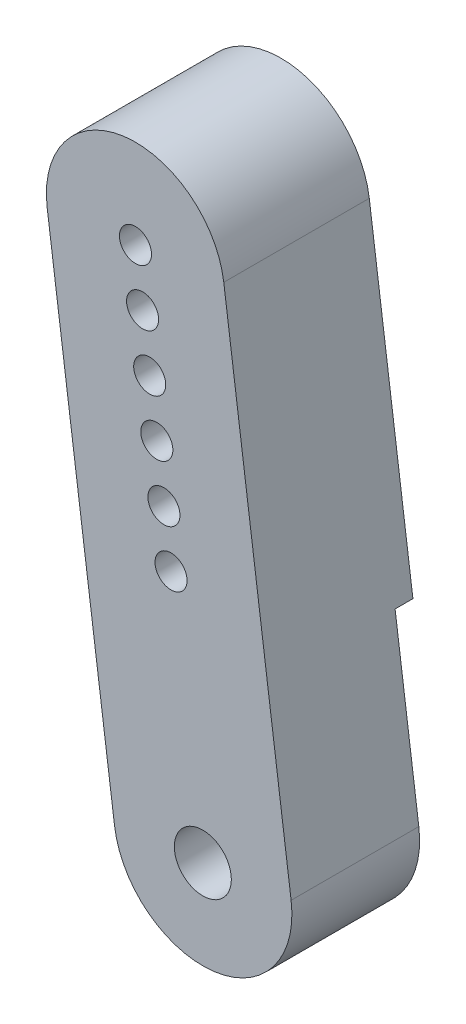
ISO-10303-21;
HEADER;
FILE_DESCRIPTION(('STEP AP214'),'2;1');
FILE_NAME('part.step','',(''),(''),'','','');
FILE_SCHEMA(('AUTOMOTIVE_DESIGN { 1 0 10303 214 1 1 1 1 }'));
ENDSEC;
DATA;
#1=APPLICATION_CONTEXT('core data for automotive mechanical design processes');
#2=APPLICATION_PROTOCOL_DEFINITION('international standard','automotive_design',2000,#1);
#3=PRODUCT_CONTEXT('',#1,'mechanical');
#4=PRODUCT('Part','Part','',(#3));
#5=PRODUCT_RELATED_PRODUCT_CATEGORY('part','',(#4));
#6=PRODUCT_DEFINITION_FORMATION('','',#4);
#7=PRODUCT_DEFINITION_CONTEXT('part definition',#1,'design');
#8=PRODUCT_DEFINITION('design','',#6,#7);
#9=PRODUCT_DEFINITION_SHAPE('','',#8);
#10=(LENGTH_UNIT() NAMED_UNIT(*) SI_UNIT(.MILLI.,.METRE.));
#11=(NAMED_UNIT(*) PLANE_ANGLE_UNIT() SI_UNIT($,.RADIAN.));
#12=(NAMED_UNIT(*) SI_UNIT($,.STERADIAN.) SOLID_ANGLE_UNIT());
#13=UNCERTAINTY_MEASURE_WITH_UNIT(LENGTH_MEASURE(1.E-05),#10,'distance_accuracy_value','');
#14=(GEOMETRIC_REPRESENTATION_CONTEXT(3) GLOBAL_UNCERTAINTY_ASSIGNED_CONTEXT((#13)) GLOBAL_UNIT_ASSIGNED_CONTEXT((#10,
#11,#12)) REPRESENTATION_CONTEXT('',''));
#15=CARTESIAN_POINT('',(0.,0.,0.));
#16=DIRECTION('',(0.,0.,1.));
#17=DIRECTION('',(1.,0.,0.));
#18=AXIS2_PLACEMENT_3D('',#15,#16,#17);
#19=CARTESIAN_POINT('',(-3.78016764213476,28.1472970744503,50.627013670889));
#20=DIRECTION('',(0.,0.,-1.));
#21=DIRECTION('',(-1.,0.,0.));
#22=AXIS2_PLACEMENT_3D('',#19,#20,#21);
#23=CYLINDRICAL_SURFACE('',#22,5.);
#24=CARTESIAN_POINT('',(-3.78016764213476,28.1472970744503,10.0670667486888));
#25=DIRECTION('',(0.,0.,1.));
#26=DIRECTION('',(1.,0.,0.));
#27=AXIS2_PLACEMENT_3D('',#24,#25,#26);
#28=CIRCLE('',#27,5.);
#29=CARTESIAN_POINT('',(1.17534240618396,28.8128195466571,10.0670667486888));
#30=VERTEX_POINT('',#29);
#31=CARTESIAN_POINT('',(-8.73567769045347,27.4817746022435,10.0670667486888));
#32=VERTEX_POINT('',#31);
#33=EDGE_CURVE('E133',#30,#32,#28,.T.);
#34=ORIENTED_EDGE('',*,*,#33,.F.);
#35=DIRECTION('',(0.,0.,-1.));
#36=VECTOR('',#35,1.);
#37=CARTESIAN_POINT('',(1.17534240618396,28.8128195466571,50.627013670889));
#38=LINE('',#37,#36);
#39=CARTESIAN_POINT('',(1.17534240618396,28.8128195466571,1.9));
#40=VERTEX_POINT('',#39);
#41=EDGE_CURVE('E43',#30,#40,#38,.T.);
#42=ORIENTED_EDGE('',*,*,#41,.T.);
#43=CARTESIAN_POINT('',(-3.78016764213475,28.1472970744503,1.9));
#44=DIRECTION('',(0.,0.,-1.));
#45=DIRECTION('',(1.,0.,0.));
#46=AXIS2_PLACEMENT_3D('',#43,#44,#45);
#47=CIRCLE('',#46,5.);
#48=CARTESIAN_POINT('',(-8.73567769045347,27.4817746022435,1.9));
#49=VERTEX_POINT('',#48);
#50=EDGE_CURVE('E105',#49,#40,#47,.T.);
#51=ORIENTED_EDGE('',*,*,#50,.F.);
#52=DIRECTION('',(0.,0.,-1.));
#53=VECTOR('',#52,1.);
#54=CARTESIAN_POINT('',(-8.73567769045347,27.4817746022435,50.627013670889));
#55=LINE('',#54,#53);
#56=EDGE_CURVE('E101',#32,#49,#55,.T.);
#57=ORIENTED_EDGE('',*,*,#56,.F.);
#58=EDGE_LOOP('',(#34,#42,#51,#57));
#59=FACE_BOUND('',#58,.T.);
#60=ADVANCED_FACE('F39',(#59),#23,.T.);
#61=CARTESIAN_POINT('',(-4.95551004831871,-0.665522472206823,50.627013670889));
#62=DIRECTION('',(0.991102009663742,0.133104494441364,0.));
#63=DIRECTION('',(-0.133104494441365,0.991102009663743,0.));
#64=AXIS2_PLACEMENT_3D('',#61,#62,#63);
#65=PLANE('',#64);
#66=DIRECTION('',(0.133104494441364,-0.991102009663742,0.));
#67=VECTOR('',#66,1.);
#68=CARTESIAN_POINT('',(-4.95551004831871,-0.665522472206828,10.0670667486888));
#69=LINE('',#68,#67);
#70=CARTESIAN_POINT('',(-4.95551004831871,-0.665522472206823,10.0670667486888));
#71=VERTEX_POINT('',#70);
#72=EDGE_CURVE('E48',#32,#71,#69,.T.);
#73=ORIENTED_EDGE('',*,*,#72,.F.);
#74=ORIENTED_EDGE('',*,*,#56,.T.);
#75=DIRECTION('',(-0.133104494441365,0.991102009663742,0.));
#76=VECTOR('',#75,1.);
#77=CARTESIAN_POINT('',(-8.73567769045347,27.4817746022435,1.9));
#78=LINE('',#77,#76);
#79=CARTESIAN_POINT('',(-6.2865549927211,9.24549762434678,1.9));
#80=VERTEX_POINT('',#79);
#81=EDGE_CURVE('E95',#80,#49,#78,.T.);
#82=ORIENTED_EDGE('',*,*,#81,.F.);
#83=DIRECTION('',(0.,0.,1.));
#84=VECTOR('',#83,1.);
#85=CARTESIAN_POINT('',(-6.2865549927211,9.24549762434678,1.9));
#86=LINE('',#85,#84);
#87=CARTESIAN_POINT('',(-6.2865549927211,9.24549762434678,2.9));
#88=VERTEX_POINT('',#87);
#89=EDGE_CURVE('E99',#80,#88,#86,.T.);
#90=ORIENTED_EDGE('',*,*,#89,.T.);
#91=DIRECTION('',(0.133104494441364,-0.991102009663742,0.));
#92=VECTOR('',#91,1.);
#93=CARTESIAN_POINT('',(-4.95551004831871,-0.665522472206823,2.9));
#94=LINE('',#93,#92);
#95=CARTESIAN_POINT('',(-4.95551004831871,-0.665522472206823,2.9));
#96=VERTEX_POINT('',#95);
#97=EDGE_CURVE('E129',#88,#96,#94,.T.);
#98=ORIENTED_EDGE('',*,*,#97,.T.);
#99=DIRECTION('',(0.,0.,-1.));
#100=VECTOR('',#99,1.);
#101=CARTESIAN_POINT('',(-4.95551004831871,-0.665522472206823,50.627013670889));
#102=LINE('',#101,#100);
#103=EDGE_CURVE('E128',#71,#96,#102,.T.);
#104=ORIENTED_EDGE('',*,*,#103,.F.);
#105=EDGE_LOOP('',(#73,#74,#82,#90,#98,#104));
#106=FACE_BOUND('',#105,.T.);
#107=ADVANCED_FACE('F97',(#106),#65,.F.);
#108=CARTESIAN_POINT('',(0.,0.,50.627013670889));
#109=DIRECTION('',(0.,0.,-1.));
#110=DIRECTION('',(-1.,0.,0.));
#111=AXIS2_PLACEMENT_3D('',#108,#109,#110);
#112=CYLINDRICAL_SURFACE('',#111,5.);
#113=CARTESIAN_POINT('',(0.,0.,10.0670667486888));
#114=DIRECTION('',(0.,0.,1.));
#115=DIRECTION('',(1.,0.,0.));
#116=AXIS2_PLACEMENT_3D('',#113,#114,#115);
#117=CIRCLE('',#116,5.);
#118=CARTESIAN_POINT('',(4.95551004831871,0.665522472206824,10.0670667486888));
#119=VERTEX_POINT('',#118);
#120=EDGE_CURVE('E11',#71,#119,#117,.T.);
#121=ORIENTED_EDGE('',*,*,#120,.F.);
#122=ORIENTED_EDGE('',*,*,#103,.T.);
#123=CARTESIAN_POINT('',(0.,0.,2.9));
#124=DIRECTION('',(0.,0.,1.));
#125=DIRECTION('',(-1.,0.,0.));
#126=AXIS2_PLACEMENT_3D('',#123,#124,#125);
#127=CIRCLE('',#126,5.);
#128=CARTESIAN_POINT('',(4.95551004831871,0.665522472206824,2.9));
#129=VERTEX_POINT('',#128);
#130=EDGE_CURVE('E125',#96,#129,#127,.T.);
#131=ORIENTED_EDGE('',*,*,#130,.T.);
#132=DIRECTION('',(0.,0.,-1.));
#133=VECTOR('',#132,1.);
#134=CARTESIAN_POINT('',(4.95551004831871,0.665522472206824,50.627013670889));
#135=LINE('',#134,#133);
#136=EDGE_CURVE('E124',#119,#129,#135,.T.);
#137=ORIENTED_EDGE('',*,*,#136,.F.);
#138=EDGE_LOOP('',(#121,#122,#131,#137));
#139=FACE_BOUND('',#138,.T.);
#140=ADVANCED_FACE('F143',(#139),#112,.T.);
#141=CARTESIAN_POINT('',(1.17534240618396,28.8128195466571,50.627013670889));
#142=DIRECTION('',(-0.991102009663742,-0.133104494441364,0.));
#143=DIRECTION('',(0.133104494441364,-0.991102009663743,0.));
#144=AXIS2_PLACEMENT_3D('',#141,#142,#143);
#145=PLANE('',#144);
#146=DIRECTION('',(-0.133104494441364,0.991102009663742,0.));
#147=VECTOR('',#146,1.);
#148=CARTESIAN_POINT('',(1.17534240618396,28.8128195466571,10.0670667486888));
#149=LINE('',#148,#147);
#150=EDGE_CURVE('E123',#119,#30,#149,.T.);
#151=ORIENTED_EDGE('',*,*,#150,.F.);
#152=ORIENTED_EDGE('',*,*,#136,.T.);
#153=DIRECTION('',(-0.133104494441364,0.991102009663742,0.));
#154=VECTOR('',#153,1.);
#155=CARTESIAN_POINT('',(1.17534240618396,28.8128195466571,2.9));
#156=LINE('',#155,#154);
#157=CARTESIAN_POINT('',(3.62446510391633,10.5765425687604,2.9));
#158=VERTEX_POINT('',#157);
#159=EDGE_CURVE('E121',#129,#158,#156,.T.);
#160=ORIENTED_EDGE('',*,*,#159,.T.);
#161=DIRECTION('',(0.,0.,1.));
#162=VECTOR('',#161,1.);
#163=CARTESIAN_POINT('',(3.62446510391633,10.5765425687604,1.9));
#164=LINE('',#163,#162);
#165=CARTESIAN_POINT('',(3.62446510391633,10.5765425687604,1.9));
#166=VERTEX_POINT('',#165);
#167=EDGE_CURVE('E116',#166,#158,#164,.T.);
#168=ORIENTED_EDGE('',*,*,#167,.F.);
#169=DIRECTION('',(0.133104494441365,-0.991102009663742,0.));
#170=VECTOR('',#169,1.);
#171=CARTESIAN_POINT('',(3.62446510391633,10.5765425687604,1.9));
#172=LINE('',#171,#170);
#173=EDGE_CURVE('E110',#40,#166,#172,.T.);
#174=ORIENTED_EDGE('',*,*,#173,.F.);
#175=ORIENTED_EDGE('',*,*,#41,.F.);
#176=EDGE_LOOP('',(#151,#152,#160,#168,#174,#175));
#177=FACE_BOUND('',#176,.T.);
#178=ADVANCED_FACE('F140',(#177),#145,.F.);
#179=CARTESIAN_POINT('',(-3.78016764213476,28.1472970744503,2.9));
#180=DIRECTION('',(0.,0.,-1.));
#181=DIRECTION('',(-1.,0.,0.));
#182=AXIS2_PLACEMENT_3D('',#179,#180,#181);
#183=PLANE('',#182);
#184=CARTESIAN_POINT('',(0.,0.,2.9));
#185=DIRECTION('',(0.,0.,-1.));
#186=DIRECTION('',(-1.,0.,0.));
#187=AXIS2_PLACEMENT_3D('',#184,#185,#186);
#188=CIRCLE('',#187,1.6);
#189=CARTESIAN_POINT('',(-1.6,0.,2.9));
#190=VERTEX_POINT('',#189);
#191=EDGE_CURVE('E288',#190,#190,#188,.T.);
#192=ORIENTED_EDGE('',*,*,#191,.F.);
#193=EDGE_LOOP('',(#192));
#194=FACE_BOUND('',#193,.T.);
#195=DIRECTION('',(-0.991102009663742,-0.133104494441365,0.));
#196=VECTOR('',#195,1.);
#197=CARTESIAN_POINT('',(-6.2865549927211,9.24549762434678,2.9));
#198=LINE('',#197,#196);
#199=EDGE_CURVE('E56',#158,#88,#198,.T.);
#200=ORIENTED_EDGE('',*,*,#199,.F.);
#201=ORIENTED_EDGE('',*,*,#159,.F.);
#202=ORIENTED_EDGE('',*,*,#130,.F.);
#203=ORIENTED_EDGE('',*,*,#97,.F.);
#204=EDGE_LOOP('',(#200,#201,#202,#203));
#205=FACE_BOUND('',#204,.T.);
#206=ADVANCED_FACE('F145',(#194,#205),#183,.T.);
#207=CARTESIAN_POINT('',(0.,-1.11022302462516E-13,10.0670667486888));
#208=DIRECTION('',(0.,0.,1.));
#209=DIRECTION('',(-0.133104494441364,0.991102009663742,0.));
#210=AXIS2_PLACEMENT_3D('',#207,#208,#209);
#211=PLANE('',#210);
#212=CARTESIAN_POINT('',(0.,0.,10.0670667486888));
#213=DIRECTION('',(0.,0.,1.));
#214=DIRECTION('',(1.,0.,0.));
#215=AXIS2_PLACEMENT_3D('',#212,#213,#214);
#216=CIRCLE('',#215,1.6);
#217=CARTESIAN_POINT('',(1.6,0.,10.0670667486888));
#218=VERTEX_POINT('',#217);
#219=EDGE_CURVE('E286',#218,#218,#216,.F.);
#220=ORIENTED_EDGE('',*,*,#219,.T.);
#221=EDGE_LOOP('',(#220));
#222=FACE_BOUND('',#221,.T.);
#223=CARTESIAN_POINT('',(-3.78016764213475,28.1472970744503,10.0670667486888));
#224=DIRECTION('',(0.,0.,1.));
#225=DIRECTION('',(1.,0.,0.));
#226=AXIS2_PLACEMENT_3D('',#223,#224,#225);
#227=CIRCLE('',#226,0.9);
#228=CARTESIAN_POINT('',(-2.88016764213475,28.1472970744503,10.0670667486888));
#229=VERTEX_POINT('',#228);
#230=EDGE_CURVE('E299',#229,#229,#227,.F.);
#231=ORIENTED_EDGE('',*,*,#230,.T.);
#232=EDGE_LOOP('',(#231));
#233=FACE_BOUND('',#232,.T.);
#234=CARTESIAN_POINT('',(-3.38085415881066,25.1739910454591,10.0670667486888));
#235=DIRECTION('',(0.,0.,1.));
#236=DIRECTION('',(1.,0.,0.));
#237=AXIS2_PLACEMENT_3D('',#234,#235,#236);
#238=CIRCLE('',#237,0.9);
#239=CARTESIAN_POINT('',(-2.48085415881066,25.1739910454591,10.0670667486888));
#240=VERTEX_POINT('',#239);
#241=EDGE_CURVE('E302',#240,#240,#238,.F.);
#242=ORIENTED_EDGE('',*,*,#241,.T.);
#243=EDGE_LOOP('',(#242));
#244=FACE_BOUND('',#243,.T.);
#245=CARTESIAN_POINT('',(-2.98154067548657,22.2006850164678,10.0670667486888));
#246=DIRECTION('',(0.,0.,1.));
#247=DIRECTION('',(1.,0.,0.));
#248=AXIS2_PLACEMENT_3D('',#245,#246,#247);
#249=CIRCLE('',#248,0.9);
#250=CARTESIAN_POINT('',(-2.08154067548657,22.2006850164678,10.0670667486888));
#251=VERTEX_POINT('',#250);
#252=EDGE_CURVE('E308',#251,#251,#249,.F.);
#253=ORIENTED_EDGE('',*,*,#252,.T.);
#254=EDGE_LOOP('',(#253));
#255=FACE_BOUND('',#254,.T.);
#256=CARTESIAN_POINT('',(-2.58222719216247,19.2273789874766,10.0670667486888));
#257=DIRECTION('',(0.,0.,1.));
#258=DIRECTION('',(1.,0.,0.));
#259=AXIS2_PLACEMENT_3D('',#256,#257,#258);
#260=CIRCLE('',#259,0.9);
#261=CARTESIAN_POINT('',(-1.68222719216247,19.2273789874766,10.0670667486888));
#262=VERTEX_POINT('',#261);
#263=EDGE_CURVE('E314',#262,#262,#260,.F.);
#264=ORIENTED_EDGE('',*,*,#263,.T.);
#265=EDGE_LOOP('',(#264));
#266=FACE_BOUND('',#265,.T.);
#267=CARTESIAN_POINT('',(-2.18291370883838,16.2540729584854,10.0670667486888));
#268=DIRECTION('',(0.,0.,1.));
#269=DIRECTION('',(1.,0.,0.));
#270=AXIS2_PLACEMENT_3D('',#267,#268,#269);
#271=CIRCLE('',#270,0.899999999999999);
#272=CARTESIAN_POINT('',(-1.28291370883838,16.2540729584854,10.0670667486888));
#273=VERTEX_POINT('',#272);
#274=EDGE_CURVE('E320',#273,#273,#271,.F.);
#275=ORIENTED_EDGE('',*,*,#274,.T.);
#276=EDGE_LOOP('',(#275));
#277=FACE_BOUND('',#276,.T.);
#278=CARTESIAN_POINT('',(-1.78360022551429,13.2807669294941,10.0670667486888));
#279=DIRECTION('',(0.,0.,1.));
#280=DIRECTION('',(1.,0.,0.));
#281=AXIS2_PLACEMENT_3D('',#278,#279,#280);
#282=CIRCLE('',#281,0.9);
#283=CARTESIAN_POINT('',(-0.883600225514286,13.2807669294941,10.0670667486888));
#284=VERTEX_POINT('',#283);
#285=EDGE_CURVE('E292',#284,#284,#282,.F.);
#286=ORIENTED_EDGE('',*,*,#285,.T.);
#287=EDGE_LOOP('',(#286));
#288=FACE_BOUND('',#287,.T.);
#289=ORIENTED_EDGE('',*,*,#150,.T.);
#290=ORIENTED_EDGE('',*,*,#33,.T.);
#291=ORIENTED_EDGE('',*,*,#72,.T.);
#292=ORIENTED_EDGE('',*,*,#120,.T.);
#293=EDGE_LOOP('',(#289,#290,#291,#292));
#294=FACE_BOUND('',#293,.T.);
#295=ADVANCED_FACE('F41',(#222,#233,#244,#255,#266,#277,#288,#294),#211,.T.);
#296=CARTESIAN_POINT('',(-6.2865549927211,9.24549762434678,1.9));
#297=DIRECTION('',(-0.133104494441365,0.991102009663742,0.));
#298=DIRECTION('',(-0.991102009663743,-0.133104494441365,0.));
#299=AXIS2_PLACEMENT_3D('',#296,#297,#298);
#300=PLANE('',#299);
#301=ORIENTED_EDGE('',*,*,#199,.T.);
#302=ORIENTED_EDGE('',*,*,#89,.F.);
#303=DIRECTION('',(-0.991102009663742,-0.133104494441365,0.));
#304=VECTOR('',#303,1.);
#305=CARTESIAN_POINT('',(-6.2865549927211,9.24549762434678,1.9));
#306=LINE('',#305,#304);
#307=EDGE_CURVE('E106',#166,#80,#306,.T.);
#308=ORIENTED_EDGE('',*,*,#307,.F.);
#309=ORIENTED_EDGE('',*,*,#167,.T.);
#310=EDGE_LOOP('',(#301,#302,#308,#309));
#311=FACE_BOUND('',#310,.T.);
#312=ADVANCED_FACE('F115',(#311),#300,.F.);
#313=CARTESIAN_POINT('',(-3.78016764213475,28.1472970744503,1.9));
#314=DIRECTION('',(0.,0.,1.));
#315=DIRECTION('',(1.,0.,0.));
#316=AXIS2_PLACEMENT_3D('',#313,#314,#315);
#317=PLANE('',#316);
#318=CARTESIAN_POINT('',(-3.78016764213475,28.1472970744503,1.9));
#319=DIRECTION('',(0.,0.,-1.));
#320=DIRECTION('',(-1.,0.,0.));
#321=AXIS2_PLACEMENT_3D('',#318,#319,#320);
#322=CIRCLE('',#321,0.9);
#323=CARTESIAN_POINT('',(-4.68016764213475,28.1472970744503,1.9));
#324=VERTEX_POINT('',#323);
#325=EDGE_CURVE('E296',#324,#324,#322,.T.);
#326=ORIENTED_EDGE('',*,*,#325,.F.);
#327=EDGE_LOOP('',(#326));
#328=FACE_BOUND('',#327,.T.);
#329=CARTESIAN_POINT('',(-3.38085415881066,25.1739910454591,1.9));
#330=DIRECTION('',(0.,0.,-1.));
#331=DIRECTION('',(-1.,0.,0.));
#332=AXIS2_PLACEMENT_3D('',#329,#330,#331);
#333=CIRCLE('',#332,0.9);
#334=CARTESIAN_POINT('',(-4.28085415881066,25.1739910454591,1.9));
#335=VERTEX_POINT('',#334);
#336=EDGE_CURVE('E305',#335,#335,#333,.T.);
#337=ORIENTED_EDGE('',*,*,#336,.F.);
#338=EDGE_LOOP('',(#337));
#339=FACE_BOUND('',#338,.T.);
#340=CARTESIAN_POINT('',(-2.98154067548657,22.2006850164678,1.9));
#341=DIRECTION('',(0.,0.,-1.));
#342=DIRECTION('',(-1.,0.,0.));
#343=AXIS2_PLACEMENT_3D('',#340,#341,#342);
#344=CIRCLE('',#343,0.9);
#345=CARTESIAN_POINT('',(-3.88154067548657,22.2006850164678,1.9));
#346=VERTEX_POINT('',#345);
#347=EDGE_CURVE('E311',#346,#346,#344,.T.);
#348=ORIENTED_EDGE('',*,*,#347,.F.);
#349=EDGE_LOOP('',(#348));
#350=FACE_BOUND('',#349,.T.);
#351=CARTESIAN_POINT('',(-2.58222719216247,19.2273789874766,1.9));
#352=DIRECTION('',(0.,0.,-1.));
#353=DIRECTION('',(-1.,0.,0.));
#354=AXIS2_PLACEMENT_3D('',#351,#352,#353);
#355=CIRCLE('',#354,0.9);
#356=CARTESIAN_POINT('',(-3.48222719216247,19.2273789874766,1.9));
#357=VERTEX_POINT('',#356);
#358=EDGE_CURVE('E317',#357,#357,#355,.T.);
#359=ORIENTED_EDGE('',*,*,#358,.F.);
#360=EDGE_LOOP('',(#359));
#361=FACE_BOUND('',#360,.T.);
#362=CARTESIAN_POINT('',(-2.18291370883838,16.2540729584854,1.9));
#363=DIRECTION('',(0.,0.,-1.));
#364=DIRECTION('',(-1.,0.,0.));
#365=AXIS2_PLACEMENT_3D('',#362,#363,#364);
#366=CIRCLE('',#365,0.899999999999999);
#367=CARTESIAN_POINT('',(-3.08291370883838,16.2540729584854,1.9));
#368=VERTEX_POINT('',#367);
#369=EDGE_CURVE('E323',#368,#368,#366,.T.);
#370=ORIENTED_EDGE('',*,*,#369,.F.);
#371=EDGE_LOOP('',(#370));
#372=FACE_BOUND('',#371,.T.);
#373=CARTESIAN_POINT('',(-1.78360022551429,13.2807669294941,1.9));
#374=DIRECTION('',(0.,0.,-1.));
#375=DIRECTION('',(-1.,0.,0.));
#376=AXIS2_PLACEMENT_3D('',#373,#374,#375);
#377=CIRCLE('',#376,0.9);
#378=CARTESIAN_POINT('',(-2.68360022551429,13.2807669294941,1.9));
#379=VERTEX_POINT('',#378);
#380=EDGE_CURVE('E289',#379,#379,#377,.T.);
#381=ORIENTED_EDGE('',*,*,#380,.F.);
#382=EDGE_LOOP('',(#381));
#383=FACE_BOUND('',#382,.T.);
#384=ORIENTED_EDGE('',*,*,#307,.T.);
#385=ORIENTED_EDGE('',*,*,#81,.T.);
#386=ORIENTED_EDGE('',*,*,#50,.T.);
#387=ORIENTED_EDGE('',*,*,#173,.T.);
#388=EDGE_LOOP('',(#384,#385,#386,#387));
#389=FACE_BOUND('',#388,.T.);
#390=ADVANCED_FACE('F109',(#328,#339,#350,#361,#372,#383,#389),#317,.F.);
#391=CARTESIAN_POINT('',(-1.78360022551429,13.2807669294941,10.0680667486888));
#392=DIRECTION('',(0.,0.,-1.));
#393=DIRECTION('',(-1.,0.,0.));
#394=AXIS2_PLACEMENT_3D('',#391,#392,#393);
#395=CYLINDRICAL_SURFACE('',#394,0.9);
#396=ORIENTED_EDGE('',*,*,#285,.F.);
#397=EDGE_LOOP('',(#396));
#398=FACE_BOUND('',#397,.T.);
#399=ORIENTED_EDGE('',*,*,#380,.T.);
#400=EDGE_LOOP('',(#399));
#401=FACE_BOUND('',#400,.T.);
#402=ADVANCED_FACE('F216',(#398,#401),#395,.F.);
#403=CARTESIAN_POINT('',(-2.18291370883838,16.2540729584854,10.0680667486888));
#404=DIRECTION('',(0.,0.,-1.));
#405=DIRECTION('',(-1.,0.,0.));
#406=AXIS2_PLACEMENT_3D('',#403,#404,#405);
#407=CYLINDRICAL_SURFACE('',#406,0.899999999999999);
#408=ORIENTED_EDGE('',*,*,#274,.F.);
#409=EDGE_LOOP('',(#408));
#410=FACE_BOUND('',#409,.T.);
#411=ORIENTED_EDGE('',*,*,#369,.T.);
#412=EDGE_LOOP('',(#411));
#413=FACE_BOUND('',#412,.T.);
#414=ADVANCED_FACE('F225',(#410,#413),#407,.F.);
#415=CARTESIAN_POINT('',(-2.58222719216247,19.2273789874766,10.0680667486888));
#416=DIRECTION('',(0.,0.,-1.));
#417=DIRECTION('',(-1.,0.,0.));
#418=AXIS2_PLACEMENT_3D('',#415,#416,#417);
#419=CYLINDRICAL_SURFACE('',#418,0.9);
#420=ORIENTED_EDGE('',*,*,#263,.F.);
#421=EDGE_LOOP('',(#420));
#422=FACE_BOUND('',#421,.T.);
#423=ORIENTED_EDGE('',*,*,#358,.T.);
#424=EDGE_LOOP('',(#423));
#425=FACE_BOUND('',#424,.T.);
#426=ADVANCED_FACE('F234',(#422,#425),#419,.F.);
#427=CARTESIAN_POINT('',(-2.98154067548657,22.2006850164678,10.0680667486888));
#428=DIRECTION('',(0.,0.,-1.));
#429=DIRECTION('',(-1.,0.,0.));
#430=AXIS2_PLACEMENT_3D('',#427,#428,#429);
#431=CYLINDRICAL_SURFACE('',#430,0.9);
#432=ORIENTED_EDGE('',*,*,#252,.F.);
#433=EDGE_LOOP('',(#432));
#434=FACE_BOUND('',#433,.T.);
#435=ORIENTED_EDGE('',*,*,#347,.T.);
#436=EDGE_LOOP('',(#435));
#437=FACE_BOUND('',#436,.T.);
#438=ADVANCED_FACE('F243',(#434,#437),#431,.F.);
#439=CARTESIAN_POINT('',(-3.38085415881066,25.1739910454591,10.0680667486888));
#440=DIRECTION('',(0.,0.,-1.));
#441=DIRECTION('',(-1.,0.,0.));
#442=AXIS2_PLACEMENT_3D('',#439,#440,#441);
#443=CYLINDRICAL_SURFACE('',#442,0.9);
#444=ORIENTED_EDGE('',*,*,#241,.F.);
#445=EDGE_LOOP('',(#444));
#446=FACE_BOUND('',#445,.T.);
#447=ORIENTED_EDGE('',*,*,#336,.T.);
#448=EDGE_LOOP('',(#447));
#449=FACE_BOUND('',#448,.T.);
#450=ADVANCED_FACE('F252',(#446,#449),#443,.F.);
#451=CARTESIAN_POINT('',(-3.78016764213475,28.1472970744503,10.0680667486888));
#452=DIRECTION('',(0.,0.,-1.));
#453=DIRECTION('',(-1.,0.,0.));
#454=AXIS2_PLACEMENT_3D('',#451,#452,#453);
#455=CYLINDRICAL_SURFACE('',#454,0.9);
#456=ORIENTED_EDGE('',*,*,#230,.F.);
#457=EDGE_LOOP('',(#456));
#458=FACE_BOUND('',#457,.T.);
#459=ORIENTED_EDGE('',*,*,#325,.T.);
#460=EDGE_LOOP('',(#459));
#461=FACE_BOUND('',#460,.T.);
#462=ADVANCED_FACE('F260',(#458,#461),#455,.F.);
#463=CARTESIAN_POINT('',(0.,0.,10.0680667486888));
#464=DIRECTION('',(0.,0.,-1.));
#465=DIRECTION('',(-1.,0.,0.));
#466=AXIS2_PLACEMENT_3D('',#463,#464,#465);
#467=CYLINDRICAL_SURFACE('',#466,1.6);
#468=ORIENTED_EDGE('',*,*,#219,.F.);
#469=EDGE_LOOP('',(#468));
#470=FACE_BOUND('',#469,.T.);
#471=ORIENTED_EDGE('',*,*,#191,.T.);
#472=EDGE_LOOP('',(#471));
#473=FACE_BOUND('',#472,.T.);
#474=ADVANCED_FACE('F268',(#470,#473),#467,.F.);
#475=CLOSED_SHELL('',(#60,#107,#140,#178,#206,#295,#312,#390,#402,#414,#426,#438,#450,#462,#474));
#476=MANIFOLD_SOLID_BREP('B2',#475);
#477=ADVANCED_BREP_SHAPE_REPRESENTATION('',(#18,#476),#14);
#478=SHAPE_DEFINITION_REPRESENTATION(#9,#477);
ENDSEC;
END-ISO-10303-21;
